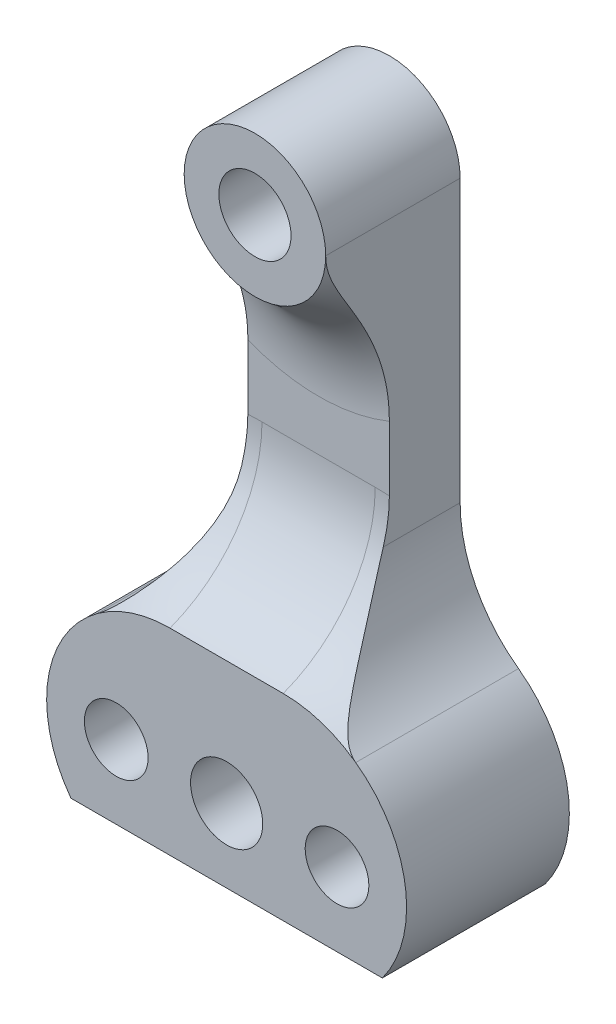
ISO-10303-21;
HEADER;
FILE_DESCRIPTION(('STEP AP214'),'2;1');
FILE_NAME('part.step','',(''),(''),'','','');
FILE_SCHEMA(('AUTOMOTIVE_DESIGN { 1 0 10303 214 1 1 1 1 }'));
ENDSEC;
DATA;
#1=APPLICATION_CONTEXT('core data for automotive mechanical design processes');
#2=APPLICATION_PROTOCOL_DEFINITION('international standard','automotive_design',2000,#1);
#3=PRODUCT_CONTEXT('',#1,'mechanical');
#4=PRODUCT('Part','Part','',(#3));
#5=PRODUCT_RELATED_PRODUCT_CATEGORY('part','',(#4));
#6=PRODUCT_DEFINITION_FORMATION('','',#4);
#7=PRODUCT_DEFINITION_CONTEXT('part definition',#1,'design');
#8=PRODUCT_DEFINITION('design','',#6,#7);
#9=PRODUCT_DEFINITION_SHAPE('','',#8);
#10=(LENGTH_UNIT() NAMED_UNIT(*) SI_UNIT(.MILLI.,.METRE.));
#11=(NAMED_UNIT(*) PLANE_ANGLE_UNIT() SI_UNIT($,.RADIAN.));
#12=(NAMED_UNIT(*) SI_UNIT($,.STERADIAN.) SOLID_ANGLE_UNIT());
#13=UNCERTAINTY_MEASURE_WITH_UNIT(LENGTH_MEASURE(1.E-05),#10,'distance_accuracy_value','');
#14=(GEOMETRIC_REPRESENTATION_CONTEXT(3) GLOBAL_UNCERTAINTY_ASSIGNED_CONTEXT((#13)) GLOBAL_UNIT_ASSIGNED_CONTEXT((#10,
#11,#12)) REPRESENTATION_CONTEXT('',''));
#15=CARTESIAN_POINT('',(0.,0.,0.));
#16=DIRECTION('',(0.,0.,1.));
#17=DIRECTION('',(1.,0.,0.));
#18=AXIS2_PLACEMENT_3D('',#15,#16,#17);
#19=CARTESIAN_POINT('',(0.,0.,0.));
#20=DIRECTION('',(0.,0.,1.));
#21=DIRECTION('',(1.,0.,0.));
#22=AXIS2_PLACEMENT_3D('',#19,#20,#21);
#23=CYLINDRICAL_SURFACE('',#22,2.55);
#24=CARTESIAN_POINT('',(0.,0.,9.5));
#25=DIRECTION('',(0.,0.,1.));
#26=DIRECTION('',(1.,0.,0.));
#27=AXIS2_PLACEMENT_3D('',#24,#25,#26);
#28=CIRCLE('',#27,2.55);
#29=CARTESIAN_POINT('',(2.55,0.,9.5));
#30=VERTEX_POINT('',#29);
#31=EDGE_CURVE('E164',#30,#30,#28,.F.);
#32=ORIENTED_EDGE('',*,*,#31,.F.);
#33=EDGE_LOOP('',(#32));
#34=FACE_BOUND('',#33,.T.);
#35=CARTESIAN_POINT('',(0.,0.,0.));
#36=DIRECTION('',(0.,0.,1.));
#37=DIRECTION('',(1.,0.,0.));
#38=AXIS2_PLACEMENT_3D('',#35,#36,#37);
#39=CIRCLE('',#38,2.55);
#40=CARTESIAN_POINT('',(2.55,0.,0.));
#41=VERTEX_POINT('',#40);
#42=EDGE_CURVE('E190',#41,#41,#39,.T.);
#43=ORIENTED_EDGE('',*,*,#42,.F.);
#44=EDGE_LOOP('',(#43));
#45=FACE_BOUND('',#44,.T.);
#46=ADVANCED_FACE('F39',(#34,#45),#23,.F.);
#47=CARTESIAN_POINT('',(0.,0.,5.));
#48=DIRECTION('',(0.,0.,1.));
#49=DIRECTION('',(1.,0.,0.));
#50=AXIS2_PLACEMENT_3D('',#47,#48,#49);
#51=PLANE('',#50);
#52=DIRECTION('',(0.,-1.,0.));
#53=VECTOR('',#52,1.);
#54=CARTESIAN_POINT('',(5.,0.,5.));
#55=LINE('',#54,#53);
#56=CARTESIAN_POINT('',(5.,-12.3800834182347,5.));
#57=VERTEX_POINT('',#56);
#58=CARTESIAN_POINT('',(5.,-16.9430334058623,5.));
#59=VERTEX_POINT('',#58);
#60=EDGE_CURVE('E151',#57,#59,#55,.T.);
#61=ORIENTED_EDGE('',*,*,#60,.F.);
#62=CARTESIAN_POINT('',(0.,0.,5.));
#63=DIRECTION('',(0.,0.,1.));
#64=DIRECTION('',(1.,0.,0.));
#65=AXIS2_PLACEMENT_3D('',#62,#63,#64);
#66=CIRCLE('',#65,13.351646544245);
#67=CARTESIAN_POINT('',(-5.,-12.3800834182347,5.));
#68=VERTEX_POINT('',#67);
#69=EDGE_CURVE('E261',#57,#68,#66,.F.);
#70=ORIENTED_EDGE('',*,*,#69,.T.);
#71=DIRECTION('',(0.,1.,0.));
#72=VECTOR('',#71,1.);
#73=CARTESIAN_POINT('',(-5.,0.,5.));
#74=LINE('',#73,#72);
#75=CARTESIAN_POINT('',(-5.,-16.9430334058623,5.));
#76=VERTEX_POINT('',#75);
#77=EDGE_CURVE('E152',#76,#68,#74,.T.);
#78=ORIENTED_EDGE('',*,*,#77,.F.);
#79=CARTESIAN_POINT('',(-4.,-35.,5.));
#80=DIRECTION('',(0.,0.,1.));
#81=DIRECTION('',(1.,0.,0.));
#82=AXIS2_PLACEMENT_3D('',#79,#80,#81);
#83=CIRCLE('',#82,18.0846355390925);
#84=CARTESIAN_POINT('',(-4.,-16.9153644609075,5.));
#85=VERTEX_POINT('',#84);
#86=EDGE_CURVE('E211',#76,#85,#83,.F.);
#87=ORIENTED_EDGE('',*,*,#86,.T.);
#88=DIRECTION('',(-1.,0.,0.));
#89=VECTOR('',#88,1.);
#90=CARTESIAN_POINT('',(4.,-16.9153644609075,5.));
#91=LINE('',#90,#89);
#92=CARTESIAN_POINT('',(4.,-16.9153644609075,5.));
#93=VERTEX_POINT('',#92);
#94=EDGE_CURVE('E209',#85,#93,#91,.F.);
#95=ORIENTED_EDGE('',*,*,#94,.T.);
#96=CARTESIAN_POINT('',(4.,-35.,5.));
#97=DIRECTION('',(0.,0.,1.));
#98=DIRECTION('',(1.,0.,0.));
#99=AXIS2_PLACEMENT_3D('',#96,#97,#98);
#100=CIRCLE('',#99,18.0846355390925);
#101=EDGE_CURVE('E213',#93,#59,#100,.F.);
#102=ORIENTED_EDGE('',*,*,#101,.T.);
#103=EDGE_LOOP('',(#61,#70,#78,#87,#95,#102));
#104=FACE_BOUND('',#103,.T.);
#105=ADVANCED_FACE('F293',(#104),#51,.T.);
#106=CARTESIAN_POINT('',(0.,0.,0.));
#107=DIRECTION('',(0.,0.,1.));
#108=DIRECTION('',(1.,0.,0.));
#109=AXIS2_PLACEMENT_3D('',#106,#107,#108);
#110=PLANE('',#109);
#111=CARTESIAN_POINT('',(-7.8,-35.,0.));
#112=DIRECTION('',(0.,0.,-1.));
#113=DIRECTION('',(-1.,0.,0.));
#114=AXIS2_PLACEMENT_3D('',#111,#112,#113);
#115=CIRCLE('',#114,4.);
#116=CARTESIAN_POINT('',(-11.8,-35.,0.));
#117=VERTEX_POINT('',#116);
#118=EDGE_CURVE('E512',#117,#117,#115,.T.);
#119=ORIENTED_EDGE('',*,*,#118,.F.);
#120=EDGE_LOOP('',(#119));
#121=FACE_BOUND('',#120,.T.);
#122=CARTESIAN_POINT('',(7.8,-35.,0.));
#123=DIRECTION('',(0.,0.,-1.));
#124=DIRECTION('',(-1.,0.,0.));
#125=AXIS2_PLACEMENT_3D('',#122,#123,#124);
#126=CIRCLE('',#125,4.);
#127=CARTESIAN_POINT('',(3.8,-35.,0.));
#128=VERTEX_POINT('',#127);
#129=EDGE_CURVE('E522',#128,#128,#126,.T.);
#130=ORIENTED_EDGE('',*,*,#129,.F.);
#131=EDGE_LOOP('',(#130));
#132=FACE_BOUND('',#131,.T.);
#133=CARTESIAN_POINT('',(-4.,-35.,0.));
#134=DIRECTION('',(0.,0.,1.));
#135=DIRECTION('',(1.,0.,0.));
#136=AXIS2_PLACEMENT_3D('',#133,#134,#135);
#137=CIRCLE('',#136,8.71713854149488);
#138=CARTESIAN_POINT('',(-11.0026388508011,-40.1914885607951,0.));
#139=VERTEX_POINT('',#138);
#140=CARTESIAN_POINT('',(-9.12303329613466,-27.9471258200425,0.));
#141=VERTEX_POINT('',#140);
#142=EDGE_CURVE('E165',#139,#141,#137,.F.);
#143=ORIENTED_EDGE('',*,*,#142,.T.);
#144=CARTESIAN_POINT('',(-15.,-19.8563123651631,0.));
#145=DIRECTION('',(0.,0.,1.));
#146=DIRECTION('',(1.,0.,0.));
#147=AXIS2_PLACEMENT_3D('',#144,#145,#146);
#148=CIRCLE('',#147,10.);
#149=CARTESIAN_POINT('',(-5.,-19.8563123651631,0.));
#150=VERTEX_POINT('',#149);
#151=EDGE_CURVE('E142',#141,#150,#148,.T.);
#152=ORIENTED_EDGE('',*,*,#151,.T.);
#153=DIRECTION('',(0.,1.,0.));
#154=VECTOR('',#153,1.);
#155=CARTESIAN_POINT('',(-5.,0.,0.));
#156=LINE('',#155,#154);
#157=CARTESIAN_POINT('',(-5.,0.,0.));
#158=VERTEX_POINT('',#157);
#159=EDGE_CURVE('E135',#150,#158,#156,.T.);
#160=ORIENTED_EDGE('',*,*,#159,.T.);
#161=CARTESIAN_POINT('',(0.,0.,0.));
#162=DIRECTION('',(0.,0.,-1.));
#163=DIRECTION('',(-1.,0.,0.));
#164=AXIS2_PLACEMENT_3D('',#161,#162,#163);
#165=CIRCLE('',#164,5.);
#166=CARTESIAN_POINT('',(5.,0.,0.));
#167=VERTEX_POINT('',#166);
#168=EDGE_CURVE('E140',#158,#167,#165,.T.);
#169=ORIENTED_EDGE('',*,*,#168,.T.);
#170=DIRECTION('',(0.,-1.,0.));
#171=VECTOR('',#170,1.);
#172=CARTESIAN_POINT('',(5.,0.,0.));
#173=LINE('',#172,#171);
#174=CARTESIAN_POINT('',(5.,-19.8563123651631,0.));
#175=VERTEX_POINT('',#174);
#176=EDGE_CURVE('E146',#167,#175,#173,.T.);
#177=ORIENTED_EDGE('',*,*,#176,.T.);
#178=CARTESIAN_POINT('',(15.,-19.8563123651631,0.));
#179=DIRECTION('',(0.,0.,1.));
#180=DIRECTION('',(1.,0.,0.));
#181=AXIS2_PLACEMENT_3D('',#178,#179,#180);
#182=CIRCLE('',#181,10.);
#183=CARTESIAN_POINT('',(9.12303329613466,-27.9471258200425,0.));
#184=VERTEX_POINT('',#183);
#185=EDGE_CURVE('E206',#175,#184,#182,.T.);
#186=ORIENTED_EDGE('',*,*,#185,.T.);
#187=CARTESIAN_POINT('',(4.,-35.,0.));
#188=DIRECTION('',(0.,0.,1.));
#189=DIRECTION('',(1.,0.,0.));
#190=AXIS2_PLACEMENT_3D('',#187,#188,#189);
#191=CIRCLE('',#190,8.71713854149488);
#192=CARTESIAN_POINT('',(11.0026388508011,-40.1914885607951,0.));
#193=VERTEX_POINT('',#192);
#194=EDGE_CURVE('E166',#184,#193,#191,.F.);
#195=ORIENTED_EDGE('',*,*,#194,.T.);
#196=DIRECTION('',(-1.,0.,0.));
#197=VECTOR('',#196,1.);
#198=CARTESIAN_POINT('',(-11.0026388508011,-40.1914885607951,0.));
#199=LINE('',#198,#197);
#200=EDGE_CURVE('E162',#193,#139,#199,.T.);
#201=ORIENTED_EDGE('',*,*,#200,.T.);
#202=EDGE_LOOP('',(#143,#152,#160,#169,#177,#186,#195,#201));
#203=FACE_BOUND('',#202,.T.);
#204=CARTESIAN_POINT('',(0.,-35.,0.));
#205=DIRECTION('',(0.,0.,1.));
#206=DIRECTION('',(1.,0.,0.));
#207=AXIS2_PLACEMENT_3D('',#204,#205,#206);
#208=CIRCLE('',#207,2.55);
#209=CARTESIAN_POINT('',(2.55,-35.,0.));
#210=VERTEX_POINT('',#209);
#211=EDGE_CURVE('E189',#210,#210,#208,.T.);
#212=ORIENTED_EDGE('',*,*,#211,.T.);
#213=EDGE_LOOP('',(#212));
#214=FACE_BOUND('',#213,.T.);
#215=ORIENTED_EDGE('',*,*,#42,.T.);
#216=EDGE_LOOP('',(#215));
#217=FACE_BOUND('',#216,.T.);
#218=ADVANCED_FACE('F137',(#121,#132,#203,#214,#217),#110,.F.);
#219=CARTESIAN_POINT('',(0.,-35.,0.));
#220=DIRECTION('',(0.,0.,1.));
#221=DIRECTION('',(1.,0.,0.));
#222=AXIS2_PLACEMENT_3D('',#219,#220,#221);
#223=CYLINDRICAL_SURFACE('',#222,2.55);
#224=ORIENTED_EDGE('',*,*,#211,.F.);
#225=EDGE_LOOP('',(#224));
#226=FACE_BOUND('',#225,.T.);
#227=CARTESIAN_POINT('',(0.,-35.,11.5));
#228=DIRECTION('',(0.,0.,-1.));
#229=DIRECTION('',(-1.,0.,0.));
#230=AXIS2_PLACEMENT_3D('',#227,#228,#229);
#231=CIRCLE('',#230,2.55);
#232=CARTESIAN_POINT('',(-2.55,-35.,11.5));
#233=VERTEX_POINT('',#232);
#234=EDGE_CURVE('E186',#233,#233,#231,.T.);
#235=ORIENTED_EDGE('',*,*,#234,.F.);
#236=EDGE_LOOP('',(#235));
#237=FACE_BOUND('',#236,.T.);
#238=ADVANCED_FACE('F354',(#226,#237),#223,.F.);
#239=CARTESIAN_POINT('',(0.,-35.,11.5));
#240=DIRECTION('',(0.,0.,1.));
#241=DIRECTION('',(1.,0.,0.));
#242=AXIS2_PLACEMENT_3D('',#239,#240,#241);
#243=PLANE('',#242);
#244=CARTESIAN_POINT('',(-7.8,-35.,11.5));
#245=DIRECTION('',(0.,0.,1.));
#246=DIRECTION('',(1.,0.,0.));
#247=AXIS2_PLACEMENT_3D('',#244,#245,#246);
#248=CIRCLE('',#247,2.25);
#249=CARTESIAN_POINT('',(-5.55,-35.,11.5));
#250=VERTEX_POINT('',#249);
#251=EDGE_CURVE('E519',#250,#250,#248,.T.);
#252=ORIENTED_EDGE('',*,*,#251,.F.);
#253=EDGE_LOOP('',(#252));
#254=FACE_BOUND('',#253,.T.);
#255=CARTESIAN_POINT('',(7.8,-35.,11.5));
#256=DIRECTION('',(0.,0.,1.));
#257=DIRECTION('',(1.,0.,0.));
#258=AXIS2_PLACEMENT_3D('',#255,#256,#257);
#259=CIRCLE('',#258,2.25);
#260=CARTESIAN_POINT('',(10.05,-35.,11.5));
#261=VERTEX_POINT('',#260);
#262=EDGE_CURVE('E269',#261,#261,#259,.T.);
#263=ORIENTED_EDGE('',*,*,#262,.F.);
#264=EDGE_LOOP('',(#263));
#265=FACE_BOUND('',#264,.T.);
#266=ORIENTED_EDGE('',*,*,#234,.T.);
#267=EDGE_LOOP('',(#266));
#268=FACE_BOUND('',#267,.T.);
#269=CARTESIAN_POINT('',(-4.,-35.,11.5));
#270=DIRECTION('',(0.,0.,1.));
#271=DIRECTION('',(1.,0.,0.));
#272=AXIS2_PLACEMENT_3D('',#269,#270,#271);
#273=CIRCLE('',#272,8.71713854149488);
#274=CARTESIAN_POINT('',(-4.,-26.2828614585051,11.5));
#275=VERTEX_POINT('',#274);
#276=CARTESIAN_POINT('',(-9.12303329613466,-27.9471258200425,11.5));
#277=VERTEX_POINT('',#276);
#278=EDGE_CURVE('E170',#275,#277,#273,.T.);
#279=ORIENTED_EDGE('',*,*,#278,.T.);
#280=CARTESIAN_POINT('',(-11.0026388508011,-40.1914885607951,11.5));
#281=VERTEX_POINT('',#280);
#282=EDGE_CURVE('E145',#277,#281,#273,.T.);
#283=ORIENTED_EDGE('',*,*,#282,.T.);
#284=DIRECTION('',(1.,0.,0.));
#285=VECTOR('',#284,1.);
#286=CARTESIAN_POINT('',(-11.0026388508011,-40.1914885607951,11.5));
#287=LINE('',#286,#285);
#288=CARTESIAN_POINT('',(11.0026388508011,-40.1914885607951,11.5));
#289=VERTEX_POINT('',#288);
#290=EDGE_CURVE('E173',#281,#289,#287,.T.);
#291=ORIENTED_EDGE('',*,*,#290,.T.);
#292=CARTESIAN_POINT('',(4.,-35.,11.5));
#293=DIRECTION('',(0.,0.,1.));
#294=DIRECTION('',(1.,0.,0.));
#295=AXIS2_PLACEMENT_3D('',#292,#293,#294);
#296=CIRCLE('',#295,8.71713854149488);
#297=CARTESIAN_POINT('',(9.12303329613466,-27.9471258200425,11.5));
#298=VERTEX_POINT('',#297);
#299=EDGE_CURVE('E177',#289,#298,#296,.T.);
#300=ORIENTED_EDGE('',*,*,#299,.T.);
#301=CARTESIAN_POINT('',(4.,-26.2828614585051,11.5));
#302=VERTEX_POINT('',#301);
#303=EDGE_CURVE('E176',#298,#302,#296,.T.);
#304=ORIENTED_EDGE('',*,*,#303,.T.);
#305=DIRECTION('',(-1.,0.,0.));
#306=VECTOR('',#305,1.);
#307=CARTESIAN_POINT('',(-4.,-26.2828614585051,11.5));
#308=LINE('',#307,#306);
#309=EDGE_CURVE('E180',#302,#275,#308,.T.);
#310=ORIENTED_EDGE('',*,*,#309,.T.);
#311=EDGE_LOOP('',(#279,#283,#291,#300,#304,#310));
#312=FACE_BOUND('',#311,.T.);
#313=ADVANCED_FACE('F308',(#254,#265,#268,#312),#243,.T.);
#314=CARTESIAN_POINT('',(0.,0.,9.5));
#315=DIRECTION('',(0.,0.,1.));
#316=DIRECTION('',(1.,0.,0.));
#317=AXIS2_PLACEMENT_3D('',#314,#315,#316);
#318=PLANE('',#317);
#319=ORIENTED_EDGE('',*,*,#31,.T.);
#320=EDGE_LOOP('',(#319));
#321=FACE_BOUND('',#320,.T.);
#322=CARTESIAN_POINT('',(0.,0.,9.5));
#323=DIRECTION('',(0.,0.,1.));
#324=DIRECTION('',(1.,0.,0.));
#325=AXIS2_PLACEMENT_3D('',#322,#323,#324);
#326=CIRCLE('',#325,5.);
#327=CARTESIAN_POINT('',(5.,0.,9.5));
#328=VERTEX_POINT('',#327);
#329=CARTESIAN_POINT('',(-5.,0.,9.5));
#330=VERTEX_POINT('',#329);
#331=EDGE_CURVE('E161',#328,#330,#326,.T.);
#332=ORIENTED_EDGE('',*,*,#331,.T.);
#333=EDGE_CURVE('E266',#330,#328,#326,.T.);
#334=ORIENTED_EDGE('',*,*,#333,.T.);
#335=EDGE_LOOP('',(#332,#334));
#336=FACE_BOUND('',#335,.T.);
#337=ADVANCED_FACE('F286',(#321,#336),#318,.T.);
#338=CARTESIAN_POINT('',(-11.0026388508011,-40.1914885607951,-28.9888316184846));
#339=DIRECTION('',(0.,-1.,0.));
#340=DIRECTION('',(0.,0.,-1.));
#341=AXIS2_PLACEMENT_3D('',#338,#339,#340);
#342=PLANE('',#341);
#343=ORIENTED_EDGE('',*,*,#200,.F.);
#344=DIRECTION('',(0.,0.,1.));
#345=VECTOR('',#344,1.);
#346=CARTESIAN_POINT('',(11.0026388508011,-40.1914885607951,-28.9888316184846));
#347=LINE('',#346,#345);
#348=EDGE_CURVE('E168',#193,#289,#347,.T.);
#349=ORIENTED_EDGE('',*,*,#348,.T.);
#350=ORIENTED_EDGE('',*,*,#290,.F.);
#351=DIRECTION('',(0.,0.,1.));
#352=VECTOR('',#351,1.);
#353=CARTESIAN_POINT('',(-11.0026388508011,-40.1914885607951,-28.9888316184846));
#354=LINE('',#353,#352);
#355=EDGE_CURVE('E182',#139,#281,#354,.T.);
#356=ORIENTED_EDGE('',*,*,#355,.F.);
#357=EDGE_LOOP('',(#343,#349,#350,#356));
#358=FACE_BOUND('',#357,.T.);
#359=ADVANCED_FACE('F314',(#358),#342,.T.);
#360=CARTESIAN_POINT('',(4.,-35.,-28.9888316184846));
#361=DIRECTION('',(0.,0.,1.));
#362=DIRECTION('',(1.,0.,0.));
#363=AXIS2_PLACEMENT_3D('',#360,#361,#362);
#364=CYLINDRICAL_SURFACE('',#363,8.71713854149488);
#365=DIRECTION('',(0.,0.,1.));
#366=VECTOR('',#365,1.);
#367=CARTESIAN_POINT('',(9.12303329613466,-27.9471258200425,-28.9888316184846));
#368=LINE('',#367,#366);
#369=EDGE_CURVE('E200',#184,#298,#368,.T.);
#370=ORIENTED_EDGE('',*,*,#369,.T.);
#371=ORIENTED_EDGE('',*,*,#299,.F.);
#372=ORIENTED_EDGE('',*,*,#348,.F.);
#373=ORIENTED_EDGE('',*,*,#194,.F.);
#374=EDGE_LOOP('',(#370,#371,#372,#373));
#375=FACE_BOUND('',#374,.T.);
#376=ADVANCED_FACE('F303',(#375),#364,.T.);
#377=CARTESIAN_POINT('',(-4.,-35.,-28.9888316184846));
#378=DIRECTION('',(0.,0.,1.));
#379=DIRECTION('',(1.,0.,0.));
#380=AXIS2_PLACEMENT_3D('',#377,#378,#379);
#381=CYLINDRICAL_SURFACE('',#380,8.71713854149488);
#382=ORIENTED_EDGE('',*,*,#282,.F.);
#383=DIRECTION('',(0.,0.,1.));
#384=VECTOR('',#383,1.);
#385=CARTESIAN_POINT('',(-9.12303329613466,-27.9471258200425,-28.9888316184846));
#386=LINE('',#385,#384);
#387=EDGE_CURVE('E204',#277,#141,#386,.F.);
#388=ORIENTED_EDGE('',*,*,#387,.T.);
#389=ORIENTED_EDGE('',*,*,#142,.F.);
#390=ORIENTED_EDGE('',*,*,#355,.T.);
#391=EDGE_LOOP('',(#382,#388,#389,#390));
#392=FACE_BOUND('',#391,.T.);
#393=ADVANCED_FACE('F317',(#392),#381,.T.);
#394=CARTESIAN_POINT('',(0.,0.,42.3450481901162));
#395=DIRECTION('',(0.,0.,-1.));
#396=DIRECTION('',(-1.,0.,0.));
#397=AXIS2_PLACEMENT_3D('',#394,#395,#396);
#398=CYLINDRICAL_SURFACE('',#397,5.);
#399=DIRECTION('',(0.,0.,-1.));
#400=VECTOR('',#399,1.);
#401=CARTESIAN_POINT('',(-5.,0.,42.3450481901162));
#402=LINE('',#401,#400);
#403=EDGE_CURVE('E60',#330,#158,#402,.T.);
#404=ORIENTED_EDGE('',*,*,#403,.F.);
#405=ORIENTED_EDGE('',*,*,#331,.F.);
#406=DIRECTION('',(0.,0.,-1.));
#407=VECTOR('',#406,1.);
#408=CARTESIAN_POINT('',(5.,0.,42.3450481901162));
#409=LINE('',#408,#407);
#410=EDGE_CURVE('E67',#328,#167,#409,.T.);
#411=ORIENTED_EDGE('',*,*,#410,.T.);
#412=ORIENTED_EDGE('',*,*,#168,.F.);
#413=EDGE_LOOP('',(#404,#405,#411,#412));
#414=FACE_BOUND('',#413,.T.);
#415=ADVANCED_FACE('F154',(#414),#398,.T.);
#416=CARTESIAN_POINT('',(-5.,0.,42.3450481901162));
#417=DIRECTION('',(-1.,0.,0.));
#418=DIRECTION('',(0.,-1.,0.));
#419=AXIS2_PLACEMENT_3D('',#416,#417,#418);
#420=PLANE('',#419);
#421=ORIENTED_EDGE('',*,*,#159,.F.);
#422=DIRECTION('',(0.,0.,-1.));
#423=VECTOR('',#422,1.);
#424=CARTESIAN_POINT('',(-5.,-19.8563123651631,5.));
#425=LINE('',#424,#423);
#426=CARTESIAN_POINT('',(-5.,-19.8563123651631,5.43215127035387));
#427=VERTEX_POINT('',#426);
#428=EDGE_CURVE('E202',#150,#427,#425,.F.);
#429=ORIENTED_EDGE('',*,*,#428,.T.);
#430=CARTESIAN_POINT('',(-5.,-19.8563123651631,5.43215127035387));
#431=CARTESIAN_POINT('',(-5.,-19.6199624145745,5.36045619307963));
#432=CARTESIAN_POINT('',(-5.,-19.380961342965,5.29750945509672));
#433=CARTESIAN_POINT('',(-5.,-18.9002709329881,5.1896808221792));
#434=CARTESIAN_POINT('',(-5.,-18.6586030138574,5.14470343272922));
#435=CARTESIAN_POINT('',(-5.,-18.1726167875473,5.07260357181103));
#436=CARTESIAN_POINT('',(-5.,-17.9282984678437,5.04548118475181));
#437=CARTESIAN_POINT('',(-5.,-17.437003713565,5.00912233782177));
#438=CARTESIAN_POINT('',(-5.,-17.1900200492365,4.99998355358992));
#439=CARTESIAN_POINT('',(-5.,-16.9430334058623,5.));
#440=B_SPLINE_CURVE_WITH_KNOTS('',3,(#430,#431,#432,#433,#434,#435,#436,#437,#438,#439),
.UNSPECIFIED.,.F.,.F.,(4,2,2,2,4),(0.,0.740782737126195,1.4775746260287,2.2143699980685,
2.95515625405431),.UNSPECIFIED.);
#441=EDGE_CURVE('E250',#427,#76,#440,.T.);
#442=ORIENTED_EDGE('',*,*,#441,.T.);
#443=ORIENTED_EDGE('',*,*,#77,.T.);
#444=CARTESIAN_POINT('',(-5.,-12.3800834182347,5.));
#445=CARTESIAN_POINT('',(-5.,-12.2035181842028,4.99999840549545));
#446=CARTESIAN_POINT('',(-5.,-12.0269816403326,5.00402126784642));
#447=CARTESIAN_POINT('',(-5.,-11.6742842672821,5.01994388788278));
#448=CARTESIAN_POINT('',(-5.,-11.4981233954146,5.03184269689178));
#449=CARTESIAN_POINT('',(-5.,-10.9710678889268,5.0790562478808));
#450=CARTESIAN_POINT('',(-5.,-10.6211469895401,5.12588901278066));
#451=CARTESIAN_POINT('',(-5.,-9.92916066705877,5.24799056085634));
#452=CARTESIAN_POINT('',(-5.,-9.5870556655782,5.3230395068316));
#453=CARTESIAN_POINT('',(-5.,-8.909660495126,5.49942109009107));
#454=CARTESIAN_POINT('',(-5.,-8.57437138023339,5.60075775993142));
#455=CARTESIAN_POINT('',(-5.,-7.97298402303867,5.80621601387656));
#456=CARTESIAN_POINT('',(-5.,-7.70551806012467,5.90638556231448));
#457=CARTESIAN_POINT('',(-5.,-7.17634313595766,6.12080341708264));
#458=CARTESIAN_POINT('',(-5.,-6.9146335377661,6.23505015644982));
#459=CARTESIAN_POINT('',(-5.,-6.39668487443849,6.47586668590197));
#460=CARTESIAN_POINT('',(-5.,-6.1404511830092,6.60244795902924));
#461=CARTESIAN_POINT('',(-5.,-5.63327139648342,6.86565293956557));
#462=CARTESIAN_POINT('',(-5.,-5.38232460753804,7.00227531849061));
#463=CARTESIAN_POINT('',(-5.,-4.99581684655964,7.22023308774813));
#464=CARTESIAN_POINT('',(-5.,-4.85879166652506,7.29900066904111));
#465=CARTESIAN_POINT('',(-5.,-4.58574719338118,7.45826214067961));
#466=CARTESIAN_POINT('',(-5.,-4.44972790773116,7.53875604380955));
#467=CARTESIAN_POINT('',(-5.,-4.17825602526108,7.70090155578766));
#468=CARTESIAN_POINT('',(-5.,-4.04280388854625,7.78255393112967));
#469=CARTESIAN_POINT('',(-5.,-3.77211514410337,7.94620521482107));
#470=CARTESIAN_POINT('',(-5.,-3.63687853035502,8.02820411324866));
#471=CARTESIAN_POINT('',(-5.,-3.36598784445081,8.19165565741036));
#472=CARTESIAN_POINT('',(-5.,-3.23033360705168,8.27310803062369));
#473=CARTESIAN_POINT('',(-5.,-2.95794498875351,8.43424650217102));
#474=CARTESIAN_POINT('',(-5.,-2.82121045373574,8.51393234208063));
#475=CARTESIAN_POINT('',(-5.,-2.54599497230289,8.66985605257229));
#476=CARTESIAN_POINT('',(-5.,-2.40751637470881,8.74609803402521));
#477=CARTESIAN_POINT('',(-5.,-2.12770128122132,8.89310819888436));
#478=CARTESIAN_POINT('',(-5.,-1.98636586057473,8.96387839508442));
#479=CARTESIAN_POINT('',(-5.,-1.73035209920845,9.08287468513336));
#480=CARTESIAN_POINT('',(-5.,-1.61641951749605,9.13268929566275));
#481=CARTESIAN_POINT('',(-5.,-1.38567277272736,9.22536806041058));
#482=CARTESIAN_POINT('',(-5.,-1.26885766500793,9.26822990025217));
#483=CARTESIAN_POINT('',(-5.,-1.03304732157865,9.34458191982193));
#484=CARTESIAN_POINT('',(-5.,-0.914072756426784,9.37813487631891));
#485=CARTESIAN_POINT('',(-5.,-0.67355736512349,9.4340014419546));
#486=CARTESIAN_POINT('',(-5.,-0.552019307205083,9.45632658711401));
#487=CARTESIAN_POINT('',(-5.,-0.358592355215246,9.4812941792774));
#488=CARTESIAN_POINT('',(-5.,-0.287248593501562,9.48826445230985));
#489=CARTESIAN_POINT('',(-5.,-0.143944272974572,9.49763873672288));
#490=CARTESIAN_POINT('',(-5.,-0.0719823822725858,9.50002227175153));
#491=CARTESIAN_POINT('',(-5.,0.,9.5));
#492=B_SPLINE_CURVE_WITH_KNOTS('',3,(#444,#445,#446,#447,#448,#449,#450,#451,#452,#453,#454,
#455,#456,#457,#458,#459,#460,#461,#462,#463,#464,#465,#466,#467,#468,#469,#470,#471,#472,#473,
#474,#475,#476,#477,#478,#479,#480,#481,#482,#483,#484,#485,#486,#487,#488,#489,#490,#491),
.UNSPECIFIED.,.F.,.F.,(4,2,2,2,2,2,2,2,2,2,2,2,2,2,2,2,2,2,2,2,2,2,2,4),(0.,0.52959667018566,
1.05912956080555,2.11684002814387,3.16647494253157,4.21627096699878,5.07267525956276,
5.92898430985543,6.78609831350217,7.64309912049908,8.1172423002689,8.59138899255667,
9.06586556542706,9.54032864370225,10.0150129440297,10.4897662332263,10.9639369735917,
11.4379324523076,11.8108050822626,12.1838015771887,12.5542178974807,12.9242528518082,
13.1391667154999,13.3550378030074),.UNSPECIFIED.);
#493=EDGE_CURVE('E53',#68,#330,#492,.T.);
#494=ORIENTED_EDGE('',*,*,#493,.T.);
#495=ORIENTED_EDGE('',*,*,#403,.T.);
#496=EDGE_LOOP('',(#421,#429,#442,#443,#494,#495));
#497=FACE_BOUND('',#496,.T.);
#498=ADVANCED_FACE('F148',(#497),#420,.T.);
#499=CARTESIAN_POINT('',(5.,0.,42.3450481901162));
#500=DIRECTION('',(1.,0.,0.));
#501=DIRECTION('',(0.,1.,0.));
#502=AXIS2_PLACEMENT_3D('',#499,#500,#501);
#503=PLANE('',#502);
#504=ORIENTED_EDGE('',*,*,#410,.F.);
#505=CARTESIAN_POINT('',(5.,0.,9.5));
#506=CARTESIAN_POINT('',(5.,-0.0592428142798295,9.50000893187561));
#507=CARTESIAN_POINT('',(5.,-0.118473386758096,9.49840009437402));
#508=CARTESIAN_POINT('',(5.,-0.236745590187068,9.49202876035376));
#509=CARTESIAN_POINT('',(5.,-0.295787277355098,9.48726731139348));
#510=CARTESIAN_POINT('',(5.,-0.47198188678186,9.46842430181486));
#511=CARTESIAN_POINT('',(5.,-0.588668915313634,9.44978278565232));
#512=CARTESIAN_POINT('',(5.,-0.817280714942397,9.40230736154222));
#513=CARTESIAN_POINT('',(5.,-0.929253979222199,9.37369917418251));
#514=CARTESIAN_POINT('',(5.,-1.15070435141623,9.30800109977393));
#515=CARTESIAN_POINT('',(5.,-1.26018015601402,9.27090689076764));
#516=CARTESIAN_POINT('',(5.,-1.55850668034188,9.15944374051666));
#517=CARTESIAN_POINT('',(5.,-1.74472713956808,9.07811070655369));
#518=CARTESIAN_POINT('',(5.,-2.11117528043778,8.90277292471352));
#519=CARTESIAN_POINT('',(5.,-2.29139412856422,8.80875044569528));
#520=CARTESIAN_POINT('',(5.,-2.64860763230571,8.61316566426022));
#521=CARTESIAN_POINT('',(5.,-2.82558587448294,8.51157379232076));
#522=CARTESIAN_POINT('',(5.,-3.17738741047761,8.30500355423443));
#523=CARTESIAN_POINT('',(5.,-3.35221187301911,8.20002714763805));
#524=CARTESIAN_POINT('',(5.,-3.70533994849458,7.98682567963584));
#525=CARTESIAN_POINT('',(5.,-3.88363176984472,7.87858120057767));
#526=CARTESIAN_POINT('',(5.,-4.2409368484491,7.66323400774345));
#527=CARTESIAN_POINT('',(5.,-4.41995018764066,7.55613142898408));
#528=CARTESIAN_POINT('',(5.,-4.77916536386445,7.34488124287007));
#529=CARTESIAN_POINT('',(5.,-4.9593635006209,7.24072738151431));
#530=CARTESIAN_POINT('',(5.,-5.3219844658955,7.03636676638719));
#531=CARTESIAN_POINT('',(5.,-5.50440720992804,6.93615986332677));
#532=CARTESIAN_POINT('',(5.,-5.87102664148322,6.74120705665234));
#533=CARTESIAN_POINT('',(5.,-6.05521041520144,6.64643700007078));
#534=CARTESIAN_POINT('',(5.,-6.42646106670012,6.46272565940431));
#535=CARTESIAN_POINT('',(5.,-6.6135280036788,6.37378449519793));
#536=CARTESIAN_POINT('',(5.,-7.17954810405599,6.11678795147897));
#537=CARTESIAN_POINT('',(5.,-7.56311519877177,5.95867079781859));
#538=CARTESIAN_POINT('',(5.,-8.33956770710378,5.67536373698116));
#539=CARTESIAN_POINT('',(5.,-8.73237915775033,5.54997258997727));
#540=CARTESIAN_POINT('',(5.,-9.52756609389128,5.33527822520325));
#541=CARTESIAN_POINT('',(5.,-9.92993463994665,5.24594962223819));
#542=CARTESIAN_POINT('',(5.,-10.6729655466423,5.11861603543273));
#543=CARTESIAN_POINT('',(5.,-11.0125736018206,5.0744913501865));
#544=CARTESIAN_POINT('',(5.,-11.5240683986888,5.03000382038349));
#545=CARTESIAN_POINT('',(5.,-11.6950567236482,5.01879095517126));
#546=CARTESIAN_POINT('',(5.,-12.0373833126818,5.00378742020659));
#547=CARTESIAN_POINT('',(5.,-12.2087216253426,4.99999786261868));
#548=CARTESIAN_POINT('',(5.,-12.3800834182347,5.));
#549=B_SPLINE_CURVE_WITH_KNOTS('',3,(#505,#506,#507,#508,#509,#510,#511,#512,#513,#514,#515,
#516,#517,#518,#519,#520,#521,#522,#523,#524,#525,#526,#527,#528,#529,#530,#531,#532,#533,#534,
#535,#536,#537,#538,#539,#540,#541,#542,#543,#544,#545,#546,#547,#548),.UNSPECIFIED.,.F.,.F.,(4,
2,2,2,2,2,2,2,2,2,2,2,2,2,2,2,2,2,2,2,2,4),(0.,0.177683781197213,0.355308550750479,
0.709171510429659,1.05549186916257,1.40198900417042,2.01071252515322,2.62029560475884,
3.23239930772968,3.84415476847003,4.46989024990624,5.09569891471709,5.72006208176829,
6.34440161029239,6.96570972074268,7.58703060517169,8.83037167554731,10.0658767292057,
11.300510561635,12.3266475481923,12.8405707795262,13.3545710012691),.UNSPECIFIED.);
#550=EDGE_CURVE('E11',#328,#57,#549,.T.);
#551=ORIENTED_EDGE('',*,*,#550,.T.);
#552=ORIENTED_EDGE('',*,*,#60,.T.);
#553=CARTESIAN_POINT('',(5.,-16.9430334058623,5.));
#554=CARTESIAN_POINT('',(5.,-17.1900200492365,4.99998355358992));
#555=CARTESIAN_POINT('',(5.,-17.437003713565,5.00912233782177));
#556=CARTESIAN_POINT('',(5.,-17.9282984678437,5.04548118475181));
#557=CARTESIAN_POINT('',(5.,-18.1726167875473,5.07260357181103));
#558=CARTESIAN_POINT('',(5.,-18.6586030138574,5.14470343272922));
#559=CARTESIAN_POINT('',(5.,-18.9002709329881,5.1896808221792));
#560=CARTESIAN_POINT('',(5.,-19.380961342965,5.29750945509672));
#561=CARTESIAN_POINT('',(5.,-19.6199624145745,5.36045619307963));
#562=CARTESIAN_POINT('',(5.,-19.8563123651631,5.43215127035388));
#563=B_SPLINE_CURVE_WITH_KNOTS('',3,(#553,#554,#555,#556,#557,#558,#559,#560,#561,#562),
.UNSPECIFIED.,.F.,.F.,(4,2,2,2,4),(0.,0.740786255985811,1.47758162802561,2.21437351692811,
2.95515625405431),.UNSPECIFIED.);
#564=CARTESIAN_POINT('',(5.,-19.8563123651631,5.43215127035387));
#565=VERTEX_POINT('',#564);
#566=EDGE_CURVE('E216',#59,#565,#563,.T.);
#567=ORIENTED_EDGE('',*,*,#566,.T.);
#568=DIRECTION('',(0.,0.,-1.));
#569=VECTOR('',#568,1.);
#570=CARTESIAN_POINT('',(5.,-19.8563123651631,0.));
#571=LINE('',#570,#569);
#572=EDGE_CURVE('E193',#565,#175,#571,.T.);
#573=ORIENTED_EDGE('',*,*,#572,.T.);
#574=ORIENTED_EDGE('',*,*,#176,.F.);
#575=EDGE_LOOP('',(#504,#551,#552,#567,#573,#574));
#576=FACE_BOUND('',#575,.T.);
#577=ADVANCED_FACE('F235',(#576),#503,.T.);
#578=CARTESIAN_POINT('',(15.,-19.8563123651631,-28.9888316184846));
#579=DIRECTION('',(0.,0.,1.));
#580=DIRECTION('',(1.,0.,0.));
#581=AXIS2_PLACEMENT_3D('',#578,#579,#580);
#582=CYLINDRICAL_SURFACE('',#581,10.);
#583=ORIENTED_EDGE('',*,*,#572,.F.);
#584=CARTESIAN_POINT('',(5.,-19.8563123651631,5.43215127035387));
#585=CARTESIAN_POINT('',(4.99999834697394,-19.9759191078667,5.46842161430926));
#586=CARTESIAN_POINT('',(5.00214624423919,-20.0948352041447,5.50688335322549));
#587=CARTESIAN_POINT('',(5.01057597429449,-20.3310404561105,5.58804547100294));
#588=CARTESIAN_POINT('',(5.01685704894965,-20.4483299061409,5.63074507130792));
#589=CARTESIAN_POINT('',(5.04162105203947,-20.7969970334518,5.7648294331228));
#590=CARTESIAN_POINT('',(5.06602608130356,-21.0256462641075,5.86234370451516));
#591=CARTESIAN_POINT('',(5.12869650706263,-21.4710391294565,6.07086711243934));
#592=CARTESIAN_POINT('',(5.16678138920477,-21.6878973182433,6.18168852780825));
#593=CARTESIAN_POINT('',(5.25531168714589,-22.1119710469674,6.41626437934502));
#594=CARTESIAN_POINT('',(5.30576337603238,-22.3191816294622,6.5400253608055));
#595=CARTESIAN_POINT('',(5.43731790413463,-22.7949810903325,6.84464243737485));
#596=CARTESIAN_POINT('',(5.52294785848966,-23.0593144722591,7.0301950264102));
#597=CARTESIAN_POINT('',(5.71086545318474,-23.5692510647739,7.41779411296668));
#598=CARTESIAN_POINT('',(5.81315937000721,-23.8148471665869,7.61984681089874));
#599=CARTESIAN_POINT('',(6.03246835915503,-24.2893667208674,8.03711715469469));
#600=CARTESIAN_POINT('',(6.14953967138249,-24.5182209024886,8.25238338957106));
#601=CARTESIAN_POINT('',(6.39684922779192,-24.9602350517473,8.69108819544934));
#602=CARTESIAN_POINT('',(6.52708443894486,-25.17339861511,8.91452487640134));
#603=CARTESIAN_POINT('',(6.72901759894777,-25.4781067797096,9.24600063655797));
#604=CARTESIAN_POINT('',(6.79541057803018,-25.5745637965651,9.35282379473989));
#605=CARTESIAN_POINT('',(6.93152972436133,-25.7650780955484,9.56648799888897));
#606=CARTESIAN_POINT('',(7.00125577319725,-25.859135462746,9.67332904408648));
#607=CARTESIAN_POINT('',(7.14448992290731,-26.0453972590334,9.88623430704547));
#608=CARTESIAN_POINT('',(7.21800033033603,-26.1376005092815,9.99229800493632));
#609=CARTESIAN_POINT('',(7.36941011339889,-26.3206934145187,10.2023934256043));
#610=CARTESIAN_POINT('',(7.44730878813869,-26.4115832763847,10.306425469323));
#611=CARTESIAN_POINT('',(7.59086962516477,-26.5729895017233,10.4883439127953));
#612=CARTESIAN_POINT('',(7.65547626357554,-26.64360918387,10.5669674183382));
#613=CARTESIAN_POINT('',(7.7886785334889,-26.7849686832509,10.7206315609605));
#614=CARTESIAN_POINT('',(7.85727307612438,-26.8557084626199,10.7956731659548));
#615=CARTESIAN_POINT('',(7.99924521027617,-26.9977056738975,10.9401747580115));
#616=CARTESIAN_POINT('',(8.07261233685975,-27.068961687778,11.0096462580325));
#617=CARTESIAN_POINT('',(8.22534445207273,-27.2126030155124,11.1402213801913));
#618=CARTESIAN_POINT('',(8.30470102357683,-27.2849866351564,11.2013364181676));
#619=CARTESIAN_POINT('',(8.46711356590453,-27.4281425076939,11.3085279665723));
#620=CARTESIAN_POINT('',(8.54986455697758,-27.4988505733617,11.3551373645321));
#621=CARTESIAN_POINT('',(8.72212946018649,-27.6409535855603,11.4310188887381));
#622=CARTESIAN_POINT('',(8.81160642819274,-27.7123431341006,11.460378889337));
#623=CARTESIAN_POINT('',(8.93949112449649,-27.8107008230382,11.4855958193539));
#624=CARTESIAN_POINT('',(8.97572421696032,-27.8381781013829,11.4909634624619));
#625=CARTESIAN_POINT('',(9.04891204290667,-27.8928942230004,11.4981776265948));
#626=CARTESIAN_POINT('',(9.08586883843213,-27.9201319133116,11.5000119083384));
#627=CARTESIAN_POINT('',(9.12303329613466,-27.9471258200425,11.5));
#628=B_SPLINE_CURVE_WITH_KNOTS('',3,(#584,#585,#586,#587,#588,#589,#590,#591,#592,#593,#594,
#595,#596,#597,#598,#599,#600,#601,#602,#603,#604,#605,#606,#607,#608,#609,#610,#611,#612,#613,
#614,#615,#616,#617,#618,#619,#620,#621,#622,#623,#624,#625,#626,#627),.UNSPECIFIED.,.F.,.F.,(4,
2,2,2,2,2,2,2,2,2,2,2,2,2,2,2,2,2,2,2,2,4),(0.,0.374870503062781,0.74967226404307,
1.49779949444993,2.23639702249818,2.97536998375759,3.97608317218995,4.97717415450388,
5.98219695572861,6.98698872017655,7.46245933799387,7.93791307646491,8.41366011488889,
8.88933138122783,9.26084755883909,9.63226276888055,10.0028893652154,10.3730044756085,
10.7272336575757,11.079642265912,11.2168846842617,11.3546016504934),.UNSPECIFIED.);
#629=EDGE_CURVE('E224',#565,#298,#628,.T.);
#630=ORIENTED_EDGE('',*,*,#629,.T.);
#631=ORIENTED_EDGE('',*,*,#369,.F.);
#632=ORIENTED_EDGE('',*,*,#185,.F.);
#633=EDGE_LOOP('',(#583,#630,#631,#632));
#634=FACE_BOUND('',#633,.T.);
#635=ADVANCED_FACE('F240',(#634),#582,.F.);
#636=CARTESIAN_POINT('',(-15.,-19.8563123651631,-28.9888316184846));
#637=DIRECTION('',(0.,0.,1.));
#638=DIRECTION('',(1.,0.,0.));
#639=AXIS2_PLACEMENT_3D('',#636,#637,#638);
#640=CYLINDRICAL_SURFACE('',#639,10.);
#641=ORIENTED_EDGE('',*,*,#151,.F.);
#642=ORIENTED_EDGE('',*,*,#387,.F.);
#643=CARTESIAN_POINT('',(-9.12303329613466,-27.9471258200425,11.5));
#644=CARTESIAN_POINT('',(-9.0764113715504,-27.9132682247074,11.5000514371017));
#645=CARTESIAN_POINT('',(-9.03011633012495,-27.8790180502772,11.4971396361444));
#646=CARTESIAN_POINT('',(-8.93866251961999,-27.8101431574128,11.4857978043171));
#647=CARTESIAN_POINT('',(-8.89350125329361,-27.7755195569947,11.4773812574789));
#648=CARTESIAN_POINT('',(-8.80554477589484,-27.7069032840578,11.4556760065544));
#649=CARTESIAN_POINT('',(-8.76271936836642,-27.6729134919957,11.4424985814357));
#650=CARTESIAN_POINT('',(-8.67855302675929,-27.6050047129115,11.4118384840162));
#651=CARTESIAN_POINT('',(-8.63721308892494,-27.5710857872645,11.3943529820108));
#652=CARTESIAN_POINT('',(-8.53338239954346,-27.4845261556332,11.3448705550382));
#653=CARTESIAN_POINT('',(-8.47201924956009,-27.432044243965,11.310232271305));
#654=CARTESIAN_POINT('',(-8.35298079963814,-27.3278186490897,11.2342064450147));
#655=CARTESIAN_POINT('',(-8.29530805203938,-27.2760754956299,11.1928143001426));
#656=CARTESIAN_POINT('',(-8.18255078452299,-27.1726172086848,11.1044883964073));
#657=CARTESIAN_POINT('',(-8.12750915616534,-27.1209110158546,11.0574901419021));
#658=CARTESIAN_POINT('',(-8.02039398682503,-27.0180581138004,10.9597574877027));
#659=CARTESIAN_POINT('',(-7.96831933888911,-26.9669112017459,10.9090244978119));
#660=CARTESIAN_POINT('',(-7.81257411639174,-26.8106683134705,10.749379784271));
#661=CARTESIAN_POINT('',(-7.71297470399565,-26.7060883259264,10.6360137242578));
#662=CARTESIAN_POINT('',(-7.52157602084517,-26.4965885771057,10.403118877069));
#663=CARTESIAN_POINT('',(-7.42978360664972,-26.3916685994807,10.2835848178318));
#664=CARTESIAN_POINT('',(-7.25210905166519,-26.1800224857467,10.0411270664165));
#665=CARTESIAN_POINT('',(-7.16624123409268,-26.0732926996856,9.91819610123327));
#666=CARTESIAN_POINT('',(-6.99956685143047,-25.8572846601553,9.67114573437119));
#667=CARTESIAN_POINT('',(-6.91876064517641,-25.7480062267553,9.54702624915148));
#668=CARTESIAN_POINT('',(-6.76163135201382,-25.5262098580873,9.29901909775034));
#669=CARTESIAN_POINT('',(-6.68530528424938,-25.4136941527441,9.17513133176734));
#670=CARTESIAN_POINT('',(-6.53675712788114,-25.1847383242443,8.92851668767492));
#671=CARTESIAN_POINT('',(-6.46453544230207,-25.068297817479,8.80578992455161));
#672=CARTESIAN_POINT('',(-6.25403341050093,-24.7126521788889,8.4410095587017));
#673=CARTESIAN_POINT('',(-6.12165362830769,-24.4667543875236,8.20193363437003));
#674=CARTESIAN_POINT('',(-5.90468831143164,-24.0181417387157,7.79563706987735));
#675=CARTESIAN_POINT('',(-5.81641939545422,-23.8199625891893,7.62537265409401));
#676=CARTESIAN_POINT('',(-5.65050159218125,-23.4109719498327,7.29487573035233));
#677=CARTESIAN_POINT('',(-5.57285614764839,-23.200156396586,7.13464648358355));
#678=CARTESIAN_POINT('',(-5.43009226843285,-22.7664296345163,6.82721242714691));
#679=CARTESIAN_POINT('',(-5.36492772393374,-22.5435670072087,6.67996080597633));
#680=CARTESIAN_POINT('',(-5.24872427503206,-22.0853074371997,6.40017651168695));
#681=CARTESIAN_POINT('',(-5.19767807593114,-21.8499170426254,6.26763625873932));
#682=CARTESIAN_POINT('',(-5.13002388854032,-21.4698470128677,6.07213102587358));
#683=CARTESIAN_POINT('',(-5.1079902749705,-21.3290148759116,6.00349027271827));
#684=CARTESIAN_POINT('',(-5.06971762084252,-21.0438233308387,5.87224222938367));
#685=CARTESIAN_POINT('',(-5.05347704705788,-20.8994648668478,5.80963334597424));
#686=CARTESIAN_POINT('',(-5.02712286347898,-20.6068990902444,5.69054387492274));
#687=CARTESIAN_POINT('',(-5.01703802655546,-20.4586770293106,5.63409306421674));
#688=CARTESIAN_POINT('',(-5.00347056161219,-20.1594436893698,5.52795436278745));
#689=CARTESIAN_POINT('',(-4.99999164185516,-20.0084308917643,5.47827028511835));
#690=CARTESIAN_POINT('',(-5.,-19.8563123651631,5.43215127035388));
#691=B_SPLINE_CURVE_WITH_KNOTS('',3,(#643,#644,#645,#646,#647,#648,#649,#650,#651,#652,#653,
#654,#655,#656,#657,#658,#659,#660,#661,#662,#663,#664,#665,#666,#667,#668,#669,#670,#671,#672,
#673,#674,#675,#676,#677,#678,#679,#680,#681,#682,#683,#684,#685,#686,#687,#688,#689,#690),
.UNSPECIFIED.,.F.,.F.,(4,2,2,2,2,2,2,2,2,2,2,2,2,2,2,2,2,2,2,2,2,2,2,4),(0.,0.17272715269459,
0.345032781975045,0.513547099108806,0.682172399165036,0.945280491339479,1.20856862905826,
1.47524711666562,1.74182544851924,2.29211390727716,2.84288077529204,3.39493561752112,
3.94702955269047,4.49875188875158,5.05052830722944,6.15222785799825,6.97901664751842,
7.80607274414989,8.63001177038785,9.45352428327963,9.92793316631622,10.4022163956481,
10.8786998537749,11.3554507091521),.UNSPECIFIED.);
#692=EDGE_CURVE('E306',#277,#427,#691,.T.);
#693=ORIENTED_EDGE('',*,*,#692,.T.);
#694=ORIENTED_EDGE('',*,*,#428,.F.);
#695=EDGE_LOOP('',(#641,#642,#693,#694));
#696=FACE_BOUND('',#695,.T.);
#697=ADVANCED_FACE('F320',(#696),#640,.F.);
#698=CARTESIAN_POINT('',(-4.,-35.,15.));
#699=DIRECTION('',(0.,0.,1.));
#700=DIRECTION('',(1.,0.,0.));
#701=AXIS2_PLACEMENT_3D('',#698,#699,#700);
#702=TOROIDAL_SURFACE('',#701,18.0846355390925,10.);
#703=ORIENTED_EDGE('',*,*,#692,.F.);
#704=ORIENTED_EDGE('',*,*,#278,.F.);
#705=CARTESIAN_POINT('',(-4.,-16.9153644609075,15.));
#706=DIRECTION('',(-1.,0.,0.));
#707=DIRECTION('',(0.,0.,1.));
#708=AXIS2_PLACEMENT_3D('',#705,#706,#707);
#709=CIRCLE('',#708,10.);
#710=EDGE_CURVE('E264',#85,#275,#709,.T.);
#711=ORIENTED_EDGE('',*,*,#710,.F.);
#712=ORIENTED_EDGE('',*,*,#86,.F.);
#713=ORIENTED_EDGE('',*,*,#441,.F.);
#714=EDGE_LOOP('',(#703,#704,#711,#712,#713));
#715=FACE_BOUND('',#714,.T.);
#716=ADVANCED_FACE('F326',(#715),#702,.F.);
#717=CARTESIAN_POINT('',(-4.,-16.9153644609075,15.));
#718=DIRECTION('',(1.,0.,0.));
#719=DIRECTION('',(0.,0.,-1.));
#720=AXIS2_PLACEMENT_3D('',#717,#718,#719);
#721=CYLINDRICAL_SURFACE('',#720,10.);
#722=ORIENTED_EDGE('',*,*,#710,.T.);
#723=ORIENTED_EDGE('',*,*,#309,.F.);
#724=CARTESIAN_POINT('',(4.,-16.9153644609075,15.));
#725=DIRECTION('',(-1.,0.,0.));
#726=DIRECTION('',(0.,0.,1.));
#727=AXIS2_PLACEMENT_3D('',#724,#725,#726);
#728=CIRCLE('',#727,10.);
#729=EDGE_CURVE('E267',#93,#302,#728,.T.);
#730=ORIENTED_EDGE('',*,*,#729,.F.);
#731=ORIENTED_EDGE('',*,*,#94,.F.);
#732=EDGE_LOOP('',(#722,#723,#730,#731));
#733=FACE_BOUND('',#732,.T.);
#734=ADVANCED_FACE('F329',(#733),#721,.F.);
#735=CARTESIAN_POINT('',(4.,-35.,15.));
#736=DIRECTION('',(0.,0.,1.));
#737=DIRECTION('',(1.,0.,0.));
#738=AXIS2_PLACEMENT_3D('',#735,#736,#737);
#739=TOROIDAL_SURFACE('',#738,18.0846355390925,10.);
#740=ORIENTED_EDGE('',*,*,#729,.T.);
#741=ORIENTED_EDGE('',*,*,#303,.F.);
#742=ORIENTED_EDGE('',*,*,#629,.F.);
#743=ORIENTED_EDGE('',*,*,#566,.F.);
#744=ORIENTED_EDGE('',*,*,#101,.F.);
#745=EDGE_LOOP('',(#740,#741,#742,#743,#744));
#746=FACE_BOUND('',#745,.T.);
#747=ADVANCED_FACE('F231',(#746),#739,.F.);
#748=CARTESIAN_POINT('',(0.,0.,15.));
#749=DIRECTION('',(0.,0.,1.));
#750=DIRECTION('',(1.,0.,0.));
#751=AXIS2_PLACEMENT_3D('',#748,#749,#750);
#752=TOROIDAL_SURFACE('',#751,13.351646544245,10.);
#753=ORIENTED_EDGE('',*,*,#550,.F.);
#754=ORIENTED_EDGE('',*,*,#333,.F.);
#755=ORIENTED_EDGE('',*,*,#493,.F.);
#756=ORIENTED_EDGE('',*,*,#69,.F.);
#757=EDGE_LOOP('',(#753,#754,#755,#756));
#758=FACE_BOUND('',#757,.T.);
#759=ADVANCED_FACE('F41',(#758),#752,.F.);
#760=CARTESIAN_POINT('',(7.8,-35.,0.));
#761=DIRECTION('',(0.,0.,-1.));
#762=DIRECTION('',(-1.,0.,0.));
#763=AXIS2_PLACEMENT_3D('',#760,#761,#762);
#764=CYLINDRICAL_SURFACE('',#763,2.25);
#765=CARTESIAN_POINT('',(7.8,-35.,4.));
#766=DIRECTION('',(0.,0.,-1.));
#767=DIRECTION('',(-1.,0.,0.));
#768=AXIS2_PLACEMENT_3D('',#765,#766,#767);
#769=CIRCLE('',#768,2.25);
#770=CARTESIAN_POINT('',(5.55,-35.,4.));
#771=VERTEX_POINT('',#770);
#772=EDGE_CURVE('E275',#771,#771,#769,.T.);
#773=ORIENTED_EDGE('',*,*,#772,.T.);
#774=EDGE_LOOP('',(#773));
#775=FACE_BOUND('',#774,.T.);
#776=ORIENTED_EDGE('',*,*,#262,.T.);
#777=EDGE_LOOP('',(#776));
#778=FACE_BOUND('',#777,.T.);
#779=ADVANCED_FACE('F241',(#775,#778),#764,.F.);
#780=CARTESIAN_POINT('',(10.05,-35.,4.));
#781=DIRECTION('',(0.,0.,1.));
#782=DIRECTION('',(1.,0.,0.));
#783=AXIS2_PLACEMENT_3D('',#780,#781,#782);
#784=PLANE('',#783);
#785=ORIENTED_EDGE('',*,*,#772,.F.);
#786=EDGE_LOOP('',(#785));
#787=FACE_BOUND('',#786,.T.);
#788=CARTESIAN_POINT('',(7.8,-35.,4.));
#789=DIRECTION('',(0.,0.,-1.));
#790=DIRECTION('',(-1.,0.,0.));
#791=AXIS2_PLACEMENT_3D('',#788,#789,#790);
#792=CIRCLE('',#791,4.);
#793=CARTESIAN_POINT('',(3.8,-35.,4.));
#794=VERTEX_POINT('',#793);
#795=EDGE_CURVE('E280',#794,#794,#792,.T.);
#796=ORIENTED_EDGE('',*,*,#795,.T.);
#797=EDGE_LOOP('',(#796));
#798=FACE_BOUND('',#797,.T.);
#799=ADVANCED_FACE('F454',(#787,#798),#784,.F.);
#800=CARTESIAN_POINT('',(7.8,-35.,0.));
#801=DIRECTION('',(0.,0.,-1.));
#802=DIRECTION('',(-1.,0.,0.));
#803=AXIS2_PLACEMENT_3D('',#800,#801,#802);
#804=CYLINDRICAL_SURFACE('',#803,4.);
#805=ORIENTED_EDGE('',*,*,#795,.F.);
#806=EDGE_LOOP('',(#805));
#807=FACE_BOUND('',#806,.T.);
#808=ORIENTED_EDGE('',*,*,#129,.T.);
#809=EDGE_LOOP('',(#808));
#810=FACE_BOUND('',#809,.T.);
#811=ADVANCED_FACE('F463',(#807,#810),#804,.F.);
#812=CARTESIAN_POINT('',(-7.8,-35.,0.));
#813=DIRECTION('',(0.,0.,-1.));
#814=DIRECTION('',(-1.,0.,0.));
#815=AXIS2_PLACEMENT_3D('',#812,#813,#814);
#816=CYLINDRICAL_SURFACE('',#815,2.25);
#817=CARTESIAN_POINT('',(-7.8,-35.,4.));
#818=DIRECTION('',(0.,0.,-1.));
#819=DIRECTION('',(-1.,0.,0.));
#820=AXIS2_PLACEMENT_3D('',#817,#818,#819);
#821=CIRCLE('',#820,2.25);
#822=CARTESIAN_POINT('',(-10.05,-35.,4.));
#823=VERTEX_POINT('',#822);
#824=EDGE_CURVE('E514',#823,#823,#821,.T.);
#825=ORIENTED_EDGE('',*,*,#824,.T.);
#826=EDGE_LOOP('',(#825));
#827=FACE_BOUND('',#826,.T.);
#828=ORIENTED_EDGE('',*,*,#251,.T.);
#829=EDGE_LOOP('',(#828));
#830=FACE_BOUND('',#829,.T.);
#831=ADVANCED_FACE('F472',(#827,#830),#816,.F.);
#832=CARTESIAN_POINT('',(-5.55,-35.,4.));
#833=DIRECTION('',(0.,0.,1.));
#834=DIRECTION('',(1.,0.,0.));
#835=AXIS2_PLACEMENT_3D('',#832,#833,#834);
#836=PLANE('',#835);
#837=ORIENTED_EDGE('',*,*,#824,.F.);
#838=EDGE_LOOP('',(#837));
#839=FACE_BOUND('',#838,.T.);
#840=CARTESIAN_POINT('',(-7.8,-35.,4.));
#841=DIRECTION('',(0.,0.,-1.));
#842=DIRECTION('',(-1.,0.,0.));
#843=AXIS2_PLACEMENT_3D('',#840,#841,#842);
#844=CIRCLE('',#843,4.);
#845=CARTESIAN_POINT('',(-11.8,-35.,4.));
#846=VERTEX_POINT('',#845);
#847=EDGE_CURVE('E509',#846,#846,#844,.T.);
#848=ORIENTED_EDGE('',*,*,#847,.T.);
#849=EDGE_LOOP('',(#848));
#850=FACE_BOUND('',#849,.T.);
#851=ADVANCED_FACE('F482',(#839,#850),#836,.F.);
#852=CARTESIAN_POINT('',(-7.8,-35.,0.));
#853=DIRECTION('',(0.,0.,-1.));
#854=DIRECTION('',(-1.,0.,0.));
#855=AXIS2_PLACEMENT_3D('',#852,#853,#854);
#856=CYLINDRICAL_SURFACE('',#855,4.);
#857=ORIENTED_EDGE('',*,*,#847,.F.);
#858=EDGE_LOOP('',(#857));
#859=FACE_BOUND('',#858,.T.);
#860=ORIENTED_EDGE('',*,*,#118,.T.);
#861=EDGE_LOOP('',(#860));
#862=FACE_BOUND('',#861,.T.);
#863=ADVANCED_FACE('F492',(#859,#862),#856,.F.);
#864=CLOSED_SHELL('',(#46,#105,#218,#238,#313,#337,#359,#376,#393,#415,#498,#577,#635,#697,#716,
#734,#747,#759,#779,#799,#811,#831,#851,#863));
#865=MANIFOLD_SOLID_BREP('B2',#864);
#866=ADVANCED_BREP_SHAPE_REPRESENTATION('',(#18,#865),#14);
#867=SHAPE_DEFINITION_REPRESENTATION(#9,#866);
ENDSEC;
END-ISO-10303-21;
